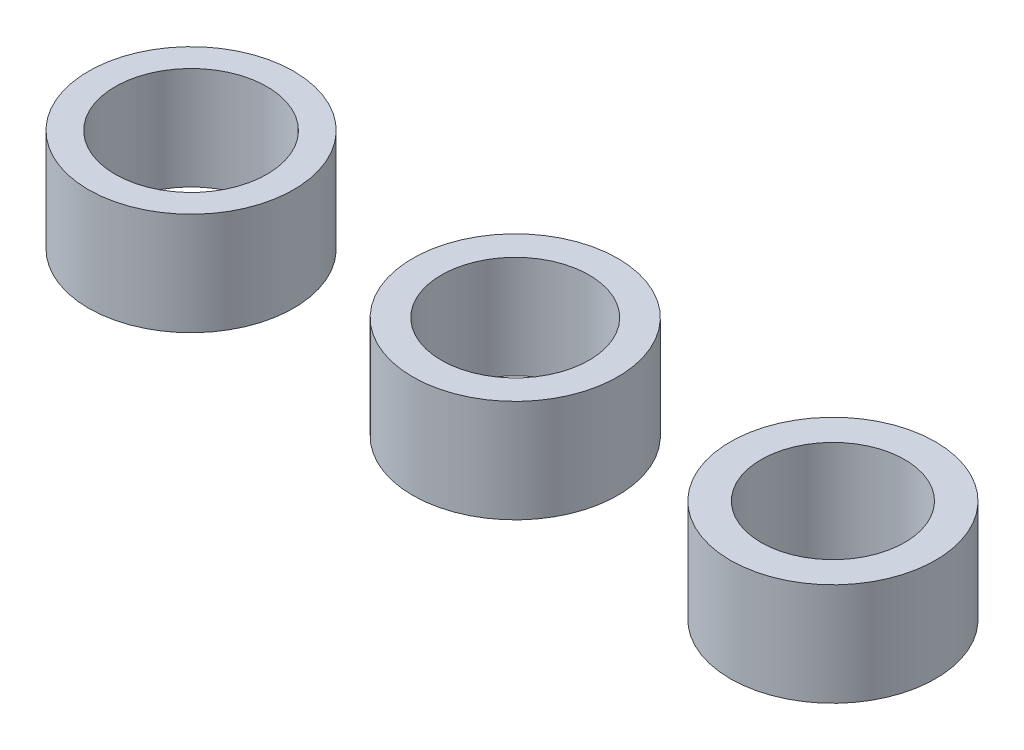
ISO-10303-21;
HEADER;
FILE_DESCRIPTION(('STEP AP214'),'2;1');
FILE_NAME('part.step','',(''),(''),'','','');
FILE_SCHEMA(('AUTOMOTIVE_DESIGN { 1 0 10303 214 1 1 1 1 }'));
ENDSEC;
DATA;
#1=APPLICATION_CONTEXT('core data for automotive mechanical design processes');
#2=APPLICATION_PROTOCOL_DEFINITION('international standard','automotive_design',2000,#1);
#3=PRODUCT_CONTEXT('',#1,'mechanical');
#4=PRODUCT('Part','Part','',(#3));
#5=PRODUCT_RELATED_PRODUCT_CATEGORY('part','',(#4));
#6=PRODUCT_DEFINITION_FORMATION('','',#4);
#7=PRODUCT_DEFINITION_CONTEXT('part definition',#1,'design');
#8=PRODUCT_DEFINITION('design','',#6,#7);
#9=PRODUCT_DEFINITION_SHAPE('','',#8);
#10=(LENGTH_UNIT() NAMED_UNIT(*) SI_UNIT(.MILLI.,.METRE.));
#11=(NAMED_UNIT(*) PLANE_ANGLE_UNIT() SI_UNIT($,.RADIAN.));
#12=(NAMED_UNIT(*) SI_UNIT($,.STERADIAN.) SOLID_ANGLE_UNIT());
#13=UNCERTAINTY_MEASURE_WITH_UNIT(LENGTH_MEASURE(1.E-05),#10,'distance_accuracy_value','');
#14=(GEOMETRIC_REPRESENTATION_CONTEXT(3) GLOBAL_UNCERTAINTY_ASSIGNED_CONTEXT((#13)) GLOBAL_UNIT_ASSIGNED_CONTEXT((#10,
#11,#12)) REPRESENTATION_CONTEXT('',''));
#15=CARTESIAN_POINT('',(0.,0.,0.));
#16=DIRECTION('',(0.,0.,1.));
#17=DIRECTION('',(1.,0.,0.));
#18=AXIS2_PLACEMENT_3D('',#15,#16,#17);
#19=CARTESIAN_POINT('',(36.7080221689997,5.,-5.00690843523902));
#20=DIRECTION('',(0.,1.,0.));
#21=DIRECTION('',(0.,0.,1.));
#22=AXIS2_PLACEMENT_3D('',#19,#20,#21);
#23=PLANE('',#22);
#24=CARTESIAN_POINT('',(36.7080221689997,5.,-5.00690843523902));
#25=DIRECTION('',(0.,1.,0.));
#26=DIRECTION('',(0.,0.,1.));
#27=AXIS2_PLACEMENT_3D('',#24,#25,#26);
#28=CIRCLE('',#27,5.);
#29=CARTESIAN_POINT('',(36.7080221689997,5.,-0.00690843523902529));
#30=VERTEX_POINT('',#29);
#31=EDGE_CURVE('E11',#30,#30,#28,.T.);
#32=ORIENTED_EDGE('',*,*,#31,.T.);
#33=EDGE_LOOP('',(#32));
#34=FACE_BOUND('',#33,.T.);
#35=CARTESIAN_POINT('',(36.7080221689997,5.,-5.00690843523902));
#36=DIRECTION('',(0.,1.,0.));
#37=DIRECTION('',(0.,0.,1.));
#38=AXIS2_PLACEMENT_3D('',#35,#36,#37);
#39=CIRCLE('',#38,3.5);
#40=CARTESIAN_POINT('',(36.7080221689997,5.,-1.50690843523902));
#41=VERTEX_POINT('',#40);
#42=EDGE_CURVE('E59',#41,#41,#39,.T.);
#43=ORIENTED_EDGE('',*,*,#42,.F.);
#44=EDGE_LOOP('',(#43));
#45=FACE_BOUND('',#44,.T.);
#46=ADVANCED_FACE('F46',(#34,#45),#23,.T.);
#47=CARTESIAN_POINT('',(36.7080221689997,0.,-5.00690843523902));
#48=DIRECTION('',(0.,1.,0.));
#49=DIRECTION('',(0.,0.,1.));
#50=AXIS2_PLACEMENT_3D('',#47,#48,#49);
#51=PLANE('',#50);
#52=CARTESIAN_POINT('',(36.7080221689997,0.,-5.00690843523902));
#53=DIRECTION('',(0.,1.,0.));
#54=DIRECTION('',(0.,0.,1.));
#55=AXIS2_PLACEMENT_3D('',#52,#53,#54);
#56=CIRCLE('',#55,5.);
#57=CARTESIAN_POINT('',(36.7080221689997,0.,-0.00690843523902529));
#58=VERTEX_POINT('',#57);
#59=EDGE_CURVE('E50',#58,#58,#56,.T.);
#60=ORIENTED_EDGE('',*,*,#59,.F.);
#61=EDGE_LOOP('',(#60));
#62=FACE_BOUND('',#61,.T.);
#63=CARTESIAN_POINT('',(36.7080221689997,0.,-5.00690843523902));
#64=DIRECTION('',(0.,1.,0.));
#65=DIRECTION('',(0.,0.,1.));
#66=AXIS2_PLACEMENT_3D('',#63,#64,#65);
#67=CIRCLE('',#66,3.5);
#68=CARTESIAN_POINT('',(36.7080221689997,0.,-1.50690843523902));
#69=VERTEX_POINT('',#68);
#70=EDGE_CURVE('E61',#69,#69,#67,.T.);
#71=ORIENTED_EDGE('',*,*,#70,.T.);
#72=EDGE_LOOP('',(#71));
#73=FACE_BOUND('',#72,.T.);
#74=ADVANCED_FACE('F73',(#62,#73),#51,.F.);
#75=CARTESIAN_POINT('',(36.7080221689997,5.,-5.00690843523902));
#76=DIRECTION('',(0.,-1.,0.));
#77=DIRECTION('',(0.,0.,-1.));
#78=AXIS2_PLACEMENT_3D('',#75,#76,#77);
#79=CYLINDRICAL_SURFACE('',#78,5.);
#80=ORIENTED_EDGE('',*,*,#31,.F.);
#81=EDGE_LOOP('',(#80));
#82=FACE_BOUND('',#81,.T.);
#83=ORIENTED_EDGE('',*,*,#59,.T.);
#84=EDGE_LOOP('',(#83));
#85=FACE_BOUND('',#84,.T.);
#86=ADVANCED_FACE('F48',(#82,#85),#79,.T.);
#87=CARTESIAN_POINT('',(36.7080221689997,5.,-5.00690843523902));
#88=DIRECTION('',(0.,-1.,0.));
#89=DIRECTION('',(0.,0.,-1.));
#90=AXIS2_PLACEMENT_3D('',#87,#88,#89);
#91=CYLINDRICAL_SURFACE('',#90,3.5);
#92=ORIENTED_EDGE('',*,*,#42,.T.);
#93=EDGE_LOOP('',(#92));
#94=FACE_BOUND('',#93,.T.);
#95=ORIENTED_EDGE('',*,*,#70,.F.);
#96=EDGE_LOOP('',(#95));
#97=FACE_BOUND('',#96,.T.);
#98=ADVANCED_FACE('F69',(#94,#97),#91,.F.);
#99=CLOSED_SHELL('',(#46,#74,#86,#98));
#100=MANIFOLD_SOLID_BREP('B2',#99);
#101=CARTESIAN_POINT('',(21.2301244710256,5.,-5.00690843523902));
#102=DIRECTION('',(0.,1.,0.));
#103=DIRECTION('',(0.,0.,1.));
#104=AXIS2_PLACEMENT_3D('',#101,#102,#103);
#105=PLANE('',#104);
#106=CARTESIAN_POINT('',(21.2301244710256,5.,-5.00690843523902));
#107=DIRECTION('',(0.,1.,0.));
#108=DIRECTION('',(0.,0.,1.));
#109=AXIS2_PLACEMENT_3D('',#106,#107,#108);
#110=CIRCLE('',#109,5.);
#111=CARTESIAN_POINT('',(21.2301244710256,5.,-0.00690843523902182));
#112=VERTEX_POINT('',#111);
#113=EDGE_CURVE('E45',#112,#112,#110,.T.);
#114=ORIENTED_EDGE('',*,*,#113,.T.);
#115=EDGE_LOOP('',(#114));
#116=FACE_BOUND('',#115,.T.);
#117=CARTESIAN_POINT('',(21.2301244710256,5.,-5.00690843523902));
#118=DIRECTION('',(0.,1.,0.));
#119=DIRECTION('',(0.,0.,1.));
#120=AXIS2_PLACEMENT_3D('',#117,#118,#119);
#121=CIRCLE('',#120,3.6);
#122=CARTESIAN_POINT('',(21.2301244710256,5.,-1.40690843523903));
#123=VERTEX_POINT('',#122);
#124=EDGE_CURVE('E130',#123,#123,#121,.T.);
#125=ORIENTED_EDGE('',*,*,#124,.F.);
#126=EDGE_LOOP('',(#125));
#127=FACE_BOUND('',#126,.T.);
#128=ADVANCED_FACE('F119',(#116,#127),#105,.T.);
#129=CARTESIAN_POINT('',(21.2301244710256,0.,-5.00690843523902));
#130=DIRECTION('',(0.,1.,0.));
#131=DIRECTION('',(0.,0.,1.));
#132=AXIS2_PLACEMENT_3D('',#129,#130,#131);
#133=PLANE('',#132);
#134=CARTESIAN_POINT('',(21.2301244710256,0.,-5.00690843523902));
#135=DIRECTION('',(0.,1.,0.));
#136=DIRECTION('',(0.,0.,1.));
#137=AXIS2_PLACEMENT_3D('',#134,#135,#136);
#138=CIRCLE('',#137,5.);
#139=CARTESIAN_POINT('',(21.2301244710256,0.,-0.00690843523902182));
#140=VERTEX_POINT('',#139);
#141=EDGE_CURVE('E123',#140,#140,#138,.T.);
#142=ORIENTED_EDGE('',*,*,#141,.F.);
#143=EDGE_LOOP('',(#142));
#144=FACE_BOUND('',#143,.T.);
#145=CARTESIAN_POINT('',(21.2301244710256,0.,-5.00690843523902));
#146=DIRECTION('',(0.,1.,0.));
#147=DIRECTION('',(0.,0.,1.));
#148=AXIS2_PLACEMENT_3D('',#145,#146,#147);
#149=CIRCLE('',#148,3.6);
#150=CARTESIAN_POINT('',(21.2301244710256,0.,-1.40690843523903));
#151=VERTEX_POINT('',#150);
#152=EDGE_CURVE('E132',#151,#151,#149,.T.);
#153=ORIENTED_EDGE('',*,*,#152,.T.);
#154=EDGE_LOOP('',(#153));
#155=FACE_BOUND('',#154,.T.);
#156=ADVANCED_FACE('F142',(#144,#155),#133,.F.);
#157=CARTESIAN_POINT('',(21.2301244710256,5.,-5.00690843523902));
#158=DIRECTION('',(0.,-1.,0.));
#159=DIRECTION('',(0.,0.,-1.));
#160=AXIS2_PLACEMENT_3D('',#157,#158,#159);
#161=CYLINDRICAL_SURFACE('',#160,5.);
#162=ORIENTED_EDGE('',*,*,#113,.F.);
#163=EDGE_LOOP('',(#162));
#164=FACE_BOUND('',#163,.T.);
#165=ORIENTED_EDGE('',*,*,#141,.T.);
#166=EDGE_LOOP('',(#165));
#167=FACE_BOUND('',#166,.T.);
#168=ADVANCED_FACE('F121',(#164,#167),#161,.T.);
#169=CARTESIAN_POINT('',(21.2301244710256,5.,-5.00690843523902));
#170=DIRECTION('',(0.,-1.,0.));
#171=DIRECTION('',(0.,0.,-1.));
#172=AXIS2_PLACEMENT_3D('',#169,#170,#171);
#173=CYLINDRICAL_SURFACE('',#172,3.6);
#174=ORIENTED_EDGE('',*,*,#124,.T.);
#175=EDGE_LOOP('',(#174));
#176=FACE_BOUND('',#175,.T.);
#177=ORIENTED_EDGE('',*,*,#152,.F.);
#178=EDGE_LOOP('',(#177));
#179=FACE_BOUND('',#178,.T.);
#180=ADVANCED_FACE('F138',(#176,#179),#173,.F.);
#181=CLOSED_SHELL('',(#128,#156,#168,#180));
#182=MANIFOLD_SOLID_BREP('B6',#181);
#183=CARTESIAN_POINT('',(5.43711938591795,5.,-5.00690843523902));
#184=DIRECTION('',(0.,1.,0.));
#185=DIRECTION('',(0.,0.,1.));
#186=AXIS2_PLACEMENT_3D('',#183,#184,#185);
#187=PLANE('',#186);
#188=CARTESIAN_POINT('',(5.43711938591795,5.,-5.00690843523902));
#189=DIRECTION('',(0.,1.,0.));
#190=DIRECTION('',(0.,0.,1.));
#191=AXIS2_PLACEMENT_3D('',#188,#189,#190);
#192=CIRCLE('',#191,5.);
#193=CARTESIAN_POINT('',(5.43711938591795,5.,-0.00690843523902182));
#194=VERTEX_POINT('',#193);
#195=EDGE_CURVE('E118',#194,#194,#192,.T.);
#196=ORIENTED_EDGE('',*,*,#195,.T.);
#197=EDGE_LOOP('',(#196));
#198=FACE_BOUND('',#197,.T.);
#199=CARTESIAN_POINT('',(5.43711938591795,5.,-5.00690843523902));
#200=DIRECTION('',(0.,1.,0.));
#201=DIRECTION('',(0.,0.,1.));
#202=AXIS2_PLACEMENT_3D('',#199,#200,#201);
#203=CIRCLE('',#202,3.7);
#204=CARTESIAN_POINT('',(5.43711938591795,5.,-1.30690843523902));
#205=VERTEX_POINT('',#204);
#206=EDGE_CURVE('E192',#205,#205,#203,.T.);
#207=ORIENTED_EDGE('',*,*,#206,.F.);
#208=EDGE_LOOP('',(#207));
#209=FACE_BOUND('',#208,.T.);
#210=ADVANCED_FACE('F181',(#198,#209),#187,.T.);
#211=CARTESIAN_POINT('',(5.43711938591795,0.,-5.00690843523902));
#212=DIRECTION('',(0.,1.,0.));
#213=DIRECTION('',(0.,0.,1.));
#214=AXIS2_PLACEMENT_3D('',#211,#212,#213);
#215=PLANE('',#214);
#216=CARTESIAN_POINT('',(5.43711938591795,0.,-5.00690843523902));
#217=DIRECTION('',(0.,1.,0.));
#218=DIRECTION('',(0.,0.,1.));
#219=AXIS2_PLACEMENT_3D('',#216,#217,#218);
#220=CIRCLE('',#219,5.);
#221=CARTESIAN_POINT('',(5.43711938591795,0.,-0.00690843523902182));
#222=VERTEX_POINT('',#221);
#223=EDGE_CURVE('E185',#222,#222,#220,.T.);
#224=ORIENTED_EDGE('',*,*,#223,.F.);
#225=EDGE_LOOP('',(#224));
#226=FACE_BOUND('',#225,.T.);
#227=CARTESIAN_POINT('',(5.43711938591795,0.,-5.00690843523902));
#228=DIRECTION('',(0.,1.,0.));
#229=DIRECTION('',(0.,0.,1.));
#230=AXIS2_PLACEMENT_3D('',#227,#228,#229);
#231=CIRCLE('',#230,3.7);
#232=CARTESIAN_POINT('',(5.43711938591795,0.,-1.30690843523902));
#233=VERTEX_POINT('',#232);
#234=EDGE_CURVE('E194',#233,#233,#231,.T.);
#235=ORIENTED_EDGE('',*,*,#234,.T.);
#236=EDGE_LOOP('',(#235));
#237=FACE_BOUND('',#236,.T.);
#238=ADVANCED_FACE('F204',(#226,#237),#215,.F.);
#239=CARTESIAN_POINT('',(5.43711938591795,5.,-5.00690843523902));
#240=DIRECTION('',(0.,-1.,0.));
#241=DIRECTION('',(0.,0.,-1.));
#242=AXIS2_PLACEMENT_3D('',#239,#240,#241);
#243=CYLINDRICAL_SURFACE('',#242,5.);
#244=ORIENTED_EDGE('',*,*,#195,.F.);
#245=EDGE_LOOP('',(#244));
#246=FACE_BOUND('',#245,.T.);
#247=ORIENTED_EDGE('',*,*,#223,.T.);
#248=EDGE_LOOP('',(#247));
#249=FACE_BOUND('',#248,.T.);
#250=ADVANCED_FACE('F183',(#246,#249),#243,.T.);
#251=CARTESIAN_POINT('',(5.43711938591795,5.,-5.00690843523902));
#252=DIRECTION('',(0.,-1.,0.));
#253=DIRECTION('',(0.,0.,-1.));
#254=AXIS2_PLACEMENT_3D('',#251,#252,#253);
#255=CYLINDRICAL_SURFACE('',#254,3.7);
#256=ORIENTED_EDGE('',*,*,#206,.T.);
#257=EDGE_LOOP('',(#256));
#258=FACE_BOUND('',#257,.T.);
#259=ORIENTED_EDGE('',*,*,#234,.F.);
#260=EDGE_LOOP('',(#259));
#261=FACE_BOUND('',#260,.T.);
#262=ADVANCED_FACE('F200',(#258,#261),#255,.F.);
#263=CLOSED_SHELL('',(#210,#238,#250,#262));
#264=MANIFOLD_SOLID_BREP('B40',#263);
#265=ADVANCED_BREP_SHAPE_REPRESENTATION('',(#18,#100,#182,#264),#14);
#266=SHAPE_DEFINITION_REPRESENTATION(#9,#265);
ENDSEC;
END-ISO-10303-21;
